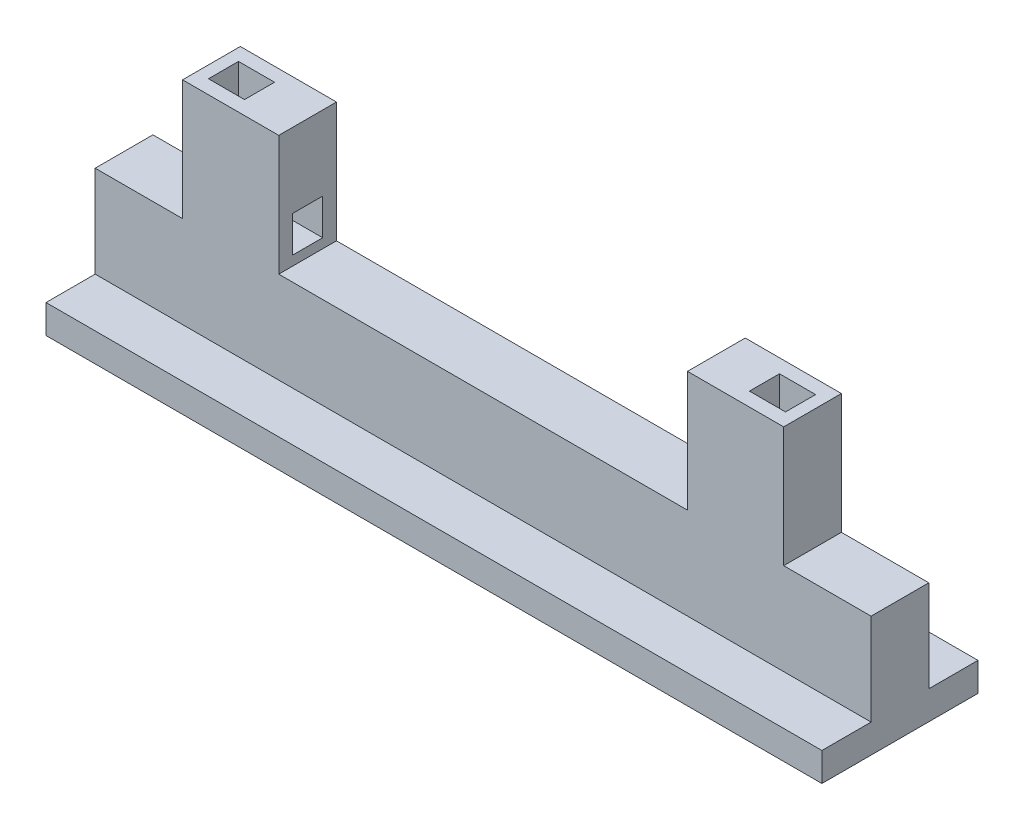
ISO-10303-21;
HEADER;
FILE_DESCRIPTION(('STEP AP214'),'2;1');
FILE_NAME('part.step','',(''),(''),'','','');
FILE_SCHEMA(('AUTOMOTIVE_DESIGN { 1 0 10303 214 1 1 1 1 }'));
ENDSEC;
DATA;
#1=APPLICATION_CONTEXT('core data for automotive mechanical design processes');
#2=APPLICATION_PROTOCOL_DEFINITION('international standard','automotive_design',2000,#1);
#3=PRODUCT_CONTEXT('',#1,'mechanical');
#4=PRODUCT('Part','Part','',(#3));
#5=PRODUCT_RELATED_PRODUCT_CATEGORY('part','',(#4));
#6=PRODUCT_DEFINITION_FORMATION('','',#4);
#7=PRODUCT_DEFINITION_CONTEXT('part definition',#1,'design');
#8=PRODUCT_DEFINITION('design','',#6,#7);
#9=PRODUCT_DEFINITION_SHAPE('','',#8);
#10=(LENGTH_UNIT() NAMED_UNIT(*) SI_UNIT(.MILLI.,.METRE.));
#11=(NAMED_UNIT(*) PLANE_ANGLE_UNIT() SI_UNIT($,.RADIAN.));
#12=(NAMED_UNIT(*) SI_UNIT($,.STERADIAN.) SOLID_ANGLE_UNIT());
#13=UNCERTAINTY_MEASURE_WITH_UNIT(LENGTH_MEASURE(1.E-05),#10,'distance_accuracy_value','');
#14=(GEOMETRIC_REPRESENTATION_CONTEXT(3) GLOBAL_UNCERTAINTY_ASSIGNED_CONTEXT((#13)) GLOBAL_UNIT_ASSIGNED_CONTEXT((#10,
#11,#12)) REPRESENTATION_CONTEXT('',''));
#15=CARTESIAN_POINT('',(0.,0.,0.));
#16=DIRECTION('',(0.,0.,1.));
#17=DIRECTION('',(1.,0.,0.));
#18=AXIS2_PLACEMENT_3D('',#15,#16,#17);
#19=CARTESIAN_POINT('',(32.27,-4.318,1.85852349845481));
#20=DIRECTION('',(0.,1.,0.));
#21=DIRECTION('',(0.,0.,1.));
#22=AXIS2_PLACEMENT_3D('',#19,#20,#21);
#23=PLANE('',#22);
#24=DIRECTION('',(0.,0.,1.));
#25=VECTOR('',#24,1.);
#26=CARTESIAN_POINT('',(57.27,-4.318,-2.94456844452775));
#27=LINE('',#26,#25);
#28=CARTESIAN_POINT('',(57.27,-4.318,-2.94456844452775));
#29=VERTEX_POINT('',#28);
#30=CARTESIAN_POINT('',(57.27,-4.318,1.85852349845481));
#31=VERTEX_POINT('',#30);
#32=EDGE_CURVE('E425',#29,#31,#27,.T.);
#33=ORIENTED_EDGE('',*,*,#32,.T.);
#34=DIRECTION('',(-1.,0.,0.));
#35=VECTOR('',#34,1.);
#36=CARTESIAN_POINT('',(32.27,-4.318,1.85852349845481));
#37=LINE('',#36,#35);
#38=CARTESIAN_POINT('',(64.54,-4.318,1.85852349845481));
#39=VERTEX_POINT('',#38);
#40=EDGE_CURVE('E617',#39,#31,#37,.T.);
#41=ORIENTED_EDGE('',*,*,#40,.F.);
#42=DIRECTION('',(0.,0.,-1.));
#43=VECTOR('',#42,1.);
#44=CARTESIAN_POINT('',(64.54,-4.318,1.85852349845481));
#45=LINE('',#44,#43);
#46=CARTESIAN_POINT('',(64.54,-4.318,-2.94456844452775));
#47=VERTEX_POINT('',#46);
#48=EDGE_CURVE('E479',#39,#47,#45,.T.);
#49=ORIENTED_EDGE('',*,*,#48,.T.);
#50=DIRECTION('',(-1.,0.,0.));
#51=VECTOR('',#50,1.);
#52=CARTESIAN_POINT('',(32.27,-4.318,-2.94456844452775));
#53=LINE('',#52,#51);
#54=EDGE_CURVE('E624',#47,#29,#53,.T.);
#55=ORIENTED_EDGE('',*,*,#54,.T.);
#56=EDGE_LOOP('',(#33,#41,#49,#55));
#57=FACE_BOUND('',#56,.T.);
#58=ADVANCED_FACE('F141',(#57),#23,.T.);
#59=CARTESIAN_POINT('',(15.27,5.682,-2.94456844452775));
#60=DIRECTION('',(-1.,0.,0.));
#61=DIRECTION('',(0.,0.,1.));
#62=AXIS2_PLACEMENT_3D('',#59,#60,#61);
#63=PLANE('',#62);
#64=DIRECTION('',(0.,0.,-1.));
#65=VECTOR('',#64,1.);
#66=CARTESIAN_POINT('',(15.27,-4.318,-2.94456844452775));
#67=LINE('',#66,#65);
#68=CARTESIAN_POINT('',(15.27,-4.318,1.85852349845481));
#69=VERTEX_POINT('',#68);
#70=CARTESIAN_POINT('',(15.27,-4.318,-2.94456844452775));
#71=VERTEX_POINT('',#70);
#72=EDGE_CURVE('E571',#69,#71,#67,.T.);
#73=ORIENTED_EDGE('',*,*,#72,.T.);
#74=DIRECTION('',(0.,-1.,0.));
#75=VECTOR('',#74,1.);
#76=CARTESIAN_POINT('',(15.27,5.682,-2.94456844452775));
#77=LINE('',#76,#75);
#78=CARTESIAN_POINT('',(15.27,5.682,-2.94456844452775));
#79=VERTEX_POINT('',#78);
#80=EDGE_CURVE('E590',#79,#71,#77,.T.);
#81=ORIENTED_EDGE('',*,*,#80,.F.);
#82=DIRECTION('',(0.,0.,-1.));
#83=VECTOR('',#82,1.);
#84=CARTESIAN_POINT('',(15.27,5.682,-2.94456844452775));
#85=LINE('',#84,#83);
#86=CARTESIAN_POINT('',(15.27,5.682,1.85852349845481));
#87=VERTEX_POINT('',#86);
#88=EDGE_CURVE('E574',#87,#79,#85,.T.);
#89=ORIENTED_EDGE('',*,*,#88,.F.);
#90=DIRECTION('',(0.,-1.,0.));
#91=VECTOR('',#90,1.);
#92=CARTESIAN_POINT('',(15.27,5.682,1.85852349845481));
#93=LINE('',#92,#91);
#94=EDGE_CURVE('E594',#87,#69,#93,.T.);
#95=ORIENTED_EDGE('',*,*,#94,.T.);
#96=EDGE_LOOP('',(#73,#81,#89,#95));
#97=FACE_BOUND('',#96,.T.);
#98=DIRECTION('',(0.,0.,1.));
#99=VECTOR('',#98,1.);
#100=CARTESIAN_POINT('',(15.27,-0.520355546125317,-1.79302247303647));
#101=LINE('',#100,#99);
#102=CARTESIAN_POINT('',(15.27,-0.520355546125317,-1.79302247303647));
#103=VERTEX_POINT('',#102);
#104=CARTESIAN_POINT('',(15.27,-0.520355546125317,0.706977526963533));
#105=VERTEX_POINT('',#104);
#106=EDGE_CURVE('E518',#103,#105,#101,.T.);
#107=ORIENTED_EDGE('',*,*,#106,.F.);
#108=DIRECTION('',(0.,-1.,0.));
#109=VECTOR('',#108,1.);
#110=CARTESIAN_POINT('',(15.27,-0.520355546125317,-1.79302247303647));
#111=LINE('',#110,#109);
#112=CARTESIAN_POINT('',(15.27,-3.52035554612532,-1.79302247303647));
#113=VERTEX_POINT('',#112);
#114=EDGE_CURVE('E549',#103,#113,#111,.T.);
#115=ORIENTED_EDGE('',*,*,#114,.T.);
#116=DIRECTION('',(0.,0.,1.));
#117=VECTOR('',#116,1.);
#118=CARTESIAN_POINT('',(15.27,-3.52035554612532,-1.79302247303647));
#119=LINE('',#118,#117);
#120=CARTESIAN_POINT('',(15.27,-3.52035554612532,0.706977526963533));
#121=VERTEX_POINT('',#120);
#122=EDGE_CURVE('E554',#113,#121,#119,.T.);
#123=ORIENTED_EDGE('',*,*,#122,.T.);
#124=DIRECTION('',(0.,-1.,0.));
#125=VECTOR('',#124,1.);
#126=CARTESIAN_POINT('',(15.27,-0.520355546125317,0.706977526963533));
#127=LINE('',#126,#125);
#128=EDGE_CURVE('E550',#105,#121,#127,.T.);
#129=ORIENTED_EDGE('',*,*,#128,.F.);
#130=EDGE_LOOP('',(#107,#115,#123,#129));
#131=FACE_BOUND('',#130,.T.);
#132=ADVANCED_FACE('F705',(#97,#131),#63,.F.);
#133=CARTESIAN_POINT('',(0.,5.682,0.));
#134=DIRECTION('',(0.,1.,0.));
#135=DIRECTION('',(0.,0.,1.));
#136=AXIS2_PLACEMENT_3D('',#133,#134,#135);
#137=PLANE('',#136);
#138=DIRECTION('',(0.,0.,1.));
#139=VECTOR('',#138,1.);
#140=CARTESIAN_POINT('',(7.27000000000001,5.682,-2.94456844452775));
#141=LINE('',#140,#139);
#142=CARTESIAN_POINT('',(7.27000000000001,5.682,-2.94456844452775));
#143=VERTEX_POINT('',#142);
#144=CARTESIAN_POINT('',(7.27000000000001,5.682,1.85852349845481));
#145=VERTEX_POINT('',#144);
#146=EDGE_CURVE('E566',#143,#145,#141,.T.);
#147=ORIENTED_EDGE('',*,*,#146,.T.);
#148=DIRECTION('',(1.,0.,0.));
#149=VECTOR('',#148,1.);
#150=CARTESIAN_POINT('',(7.27000000000001,5.682,1.85852349845481));
#151=LINE('',#150,#149);
#152=EDGE_CURVE('E570',#145,#87,#151,.T.);
#153=ORIENTED_EDGE('',*,*,#152,.T.);
#154=ORIENTED_EDGE('',*,*,#88,.T.);
#155=DIRECTION('',(-1.,0.,0.));
#156=VECTOR('',#155,1.);
#157=CARTESIAN_POINT('',(7.27000000000001,5.682,-2.94456844452775));
#158=LINE('',#157,#156);
#159=EDGE_CURVE('E577',#79,#143,#158,.T.);
#160=ORIENTED_EDGE('',*,*,#159,.T.);
#161=EDGE_LOOP('',(#147,#153,#154,#160));
#162=FACE_BOUND('',#161,.T.);
#163=DIRECTION('',(0.,0.,1.));
#164=VECTOR('',#163,1.);
#165=CARTESIAN_POINT('',(11.27,5.682,-1.79302247303647));
#166=LINE('',#165,#164);
#167=CARTESIAN_POINT('',(11.27,5.682,-1.79302247303647));
#168=VERTEX_POINT('',#167);
#169=CARTESIAN_POINT('',(11.27,5.682,0.706977526963533));
#170=VERTEX_POINT('',#169);
#171=EDGE_CURVE('E512',#168,#170,#166,.T.);
#172=ORIENTED_EDGE('',*,*,#171,.T.);
#173=DIRECTION('',(-1.,0.,0.));
#174=VECTOR('',#173,1.);
#175=CARTESIAN_POINT('',(0.,5.682,0.706977526963533));
#176=LINE('',#175,#174);
#177=CARTESIAN_POINT('',(8.27000000000001,5.682,0.706977526963533));
#178=VERTEX_POINT('',#177);
#179=EDGE_CURVE('E497',#170,#178,#176,.T.);
#180=ORIENTED_EDGE('',*,*,#179,.T.);
#181=DIRECTION('',(0.,0.,1.));
#182=VECTOR('',#181,1.);
#183=CARTESIAN_POINT('',(8.27000000000001,5.682,-1.79302247303647));
#184=LINE('',#183,#182);
#185=CARTESIAN_POINT('',(8.27000000000001,5.682,-1.79302247303647));
#186=VERTEX_POINT('',#185);
#187=EDGE_CURVE('E535',#186,#178,#184,.T.);
#188=ORIENTED_EDGE('',*,*,#187,.F.);
#189=DIRECTION('',(-1.,0.,0.));
#190=VECTOR('',#189,1.);
#191=CARTESIAN_POINT('',(0.,5.682,-1.79302247303647));
#192=LINE('',#191,#190);
#193=EDGE_CURVE('E508',#168,#186,#192,.T.);
#194=ORIENTED_EDGE('',*,*,#193,.F.);
#195=EDGE_LOOP('',(#172,#180,#188,#194));
#196=FACE_BOUND('',#195,.T.);
#197=ADVANCED_FACE('F693',(#162,#196),#137,.T.);
#198=DIRECTION('',(0.,0.,1.));
#199=VECTOR('',#198,1.);
#200=CARTESIAN_POINT('',(7.27000000000001,-4.318,-2.94456844452775));
#201=LINE('',#200,#199);
#202=CARTESIAN_POINT('',(7.27000000000001,-4.318,-2.94456844452775));
#203=VERTEX_POINT('',#202);
#204=CARTESIAN_POINT('',(7.27000000000001,-4.318,1.85852349845481));
#205=VERTEX_POINT('',#204);
#206=EDGE_CURVE('E544',#203,#205,#201,.T.);
#207=ORIENTED_EDGE('',*,*,#206,.F.);
#208=CARTESIAN_POINT('',(0.,-4.318,-2.94456844452775));
#209=VERTEX_POINT('',#208);
#210=EDGE_CURVE('E616',#203,#209,#53,.T.);
#211=ORIENTED_EDGE('',*,*,#210,.T.);
#212=DIRECTION('',(0.,0.,-1.));
#213=VECTOR('',#212,1.);
#214=CARTESIAN_POINT('',(0.,-4.318,1.85852349845481));
#215=LINE('',#214,#213);
#216=CARTESIAN_POINT('',(0.,-4.318,1.85852349845481));
#217=VERTEX_POINT('',#216);
#218=EDGE_CURVE('E603',#217,#209,#215,.T.);
#219=ORIENTED_EDGE('',*,*,#218,.F.);
#220=EDGE_CURVE('E623',#205,#217,#37,.T.);
#221=ORIENTED_EDGE('',*,*,#220,.F.);
#222=EDGE_LOOP('',(#207,#211,#219,#221));
#223=FACE_BOUND('',#222,.T.);
#224=ADVANCED_FACE('F712',(#223),#23,.T.);
#225=CARTESIAN_POINT('',(32.27,-4.318,-2.94456844452775));
#226=DIRECTION('',(0.,0.,-1.));
#227=DIRECTION('',(0.,1.,0.));
#228=AXIS2_PLACEMENT_3D('',#225,#226,#227);
#229=PLANE('',#228);
#230=DIRECTION('',(1.,0.,0.));
#231=VECTOR('',#230,1.);
#232=CARTESIAN_POINT('',(32.27,-11.9498189556856,-2.94456844452775));
#233=LINE('',#232,#231);
#234=CARTESIAN_POINT('',(0.,-11.9498189556856,-2.94456844452775));
#235=VERTEX_POINT('',#234);
#236=CARTESIAN_POINT('',(64.54,-11.9498189556856,-2.94456844452775));
#237=VERTEX_POINT('',#236);
#238=EDGE_CURVE('E621',#235,#237,#233,.T.);
#239=ORIENTED_EDGE('',*,*,#238,.F.);
#240=DIRECTION('',(0.,-1.,0.));
#241=VECTOR('',#240,1.);
#242=CARTESIAN_POINT('',(0.,-4.318,-2.94456844452775));
#243=LINE('',#242,#241);
#244=EDGE_CURVE('E607',#209,#235,#243,.T.);
#245=ORIENTED_EDGE('',*,*,#244,.F.);
#246=ORIENTED_EDGE('',*,*,#210,.F.);
#247=DIRECTION('',(0.,-1.,0.));
#248=VECTOR('',#247,1.);
#249=CARTESIAN_POINT('',(7.27000000000001,5.682,-2.94456844452775));
#250=LINE('',#249,#248);
#251=EDGE_CURVE('E580',#143,#203,#250,.T.);
#252=ORIENTED_EDGE('',*,*,#251,.F.);
#253=ORIENTED_EDGE('',*,*,#159,.F.);
#254=ORIENTED_EDGE('',*,*,#80,.T.);
#255=CARTESIAN_POINT('',(49.27,-4.318,-2.94456844452775));
#256=VERTEX_POINT('',#255);
#257=EDGE_CURVE('E628',#256,#71,#53,.T.);
#258=ORIENTED_EDGE('',*,*,#257,.F.);
#259=DIRECTION('',(0.,-1.,0.));
#260=VECTOR('',#259,1.);
#261=CARTESIAN_POINT('',(49.27,5.682,-2.94456844452775));
#262=LINE('',#261,#260);
#263=CARTESIAN_POINT('',(49.27,5.682,-2.94456844452775));
#264=VERTEX_POINT('',#263);
#265=EDGE_CURVE('E456',#264,#256,#262,.T.);
#266=ORIENTED_EDGE('',*,*,#265,.F.);
#267=DIRECTION('',(1.,0.,0.));
#268=VECTOR('',#267,1.);
#269=CARTESIAN_POINT('',(57.27,5.682,-2.94456844452775));
#270=LINE('',#269,#268);
#271=CARTESIAN_POINT('',(57.27,5.682,-2.94456844452775));
#272=VERTEX_POINT('',#271);
#273=EDGE_CURVE('E430',#264,#272,#270,.T.);
#274=ORIENTED_EDGE('',*,*,#273,.T.);
#275=DIRECTION('',(0.,-1.,0.));
#276=VECTOR('',#275,1.);
#277=CARTESIAN_POINT('',(57.27,5.682,-2.94456844452775));
#278=LINE('',#277,#276);
#279=EDGE_CURVE('E459',#272,#29,#278,.T.);
#280=ORIENTED_EDGE('',*,*,#279,.T.);
#281=ORIENTED_EDGE('',*,*,#54,.F.);
#282=DIRECTION('',(0.,-1.,0.));
#283=VECTOR('',#282,1.);
#284=CARTESIAN_POINT('',(64.54,-4.318,-2.94456844452775));
#285=LINE('',#284,#283);
#286=EDGE_CURVE('E487',#47,#237,#285,.T.);
#287=ORIENTED_EDGE('',*,*,#286,.T.);
#288=EDGE_LOOP('',(#239,#245,#246,#252,#253,#254,#258,#266,#274,#280,#281,#287));
#289=FACE_BOUND('',#288,.T.);
#290=ADVANCED_FACE('F736',(#289),#229,.T.);
#291=DIRECTION('',(0.,0.,-1.));
#292=VECTOR('',#291,1.);
#293=CARTESIAN_POINT('',(49.27,-4.318,-2.94456844452775));
#294=LINE('',#293,#292);
#295=CARTESIAN_POINT('',(49.27,-4.318,1.85852349845481));
#296=VERTEX_POINT('',#295);
#297=EDGE_CURVE('E431',#296,#256,#294,.T.);
#298=ORIENTED_EDGE('',*,*,#297,.T.);
#299=ORIENTED_EDGE('',*,*,#257,.T.);
#300=ORIENTED_EDGE('',*,*,#72,.F.);
#301=EDGE_CURVE('E622',#296,#69,#37,.T.);
#302=ORIENTED_EDGE('',*,*,#301,.F.);
#303=EDGE_LOOP('',(#298,#299,#300,#302));
#304=FACE_BOUND('',#303,.T.);
#305=ADVANCED_FACE('F718',(#304),#23,.T.);
#306=CARTESIAN_POINT('',(32.27,-4.318,1.85852349845481));
#307=DIRECTION('',(0.,0.,-1.));
#308=DIRECTION('',(-1.,0.,0.));
#309=AXIS2_PLACEMENT_3D('',#306,#307,#308);
#310=PLANE('',#309);
#311=DIRECTION('',(0.,-1.,0.));
#312=VECTOR('',#311,1.);
#313=CARTESIAN_POINT('',(0.,-4.318,1.85852349845481));
#314=LINE('',#313,#312);
#315=CARTESIAN_POINT('',(0.,-11.9498189556856,1.85852349845481));
#316=VERTEX_POINT('',#315);
#317=EDGE_CURVE('E612',#217,#316,#314,.T.);
#318=ORIENTED_EDGE('',*,*,#317,.T.);
#319=DIRECTION('',(1.,0.,0.));
#320=VECTOR('',#319,1.);
#321=CARTESIAN_POINT('',(32.27,-11.9498189556856,1.85852349845481));
#322=LINE('',#321,#320);
#323=CARTESIAN_POINT('',(64.54,-11.9498189556856,1.85852349845481));
#324=VERTEX_POINT('',#323);
#325=EDGE_CURVE('E660',#316,#324,#322,.T.);
#326=ORIENTED_EDGE('',*,*,#325,.T.);
#327=DIRECTION('',(0.,-1.,0.));
#328=VECTOR('',#327,1.);
#329=CARTESIAN_POINT('',(64.54,-4.318,1.85852349845481));
#330=LINE('',#329,#328);
#331=EDGE_CURVE('E483',#39,#324,#330,.T.);
#332=ORIENTED_EDGE('',*,*,#331,.F.);
#333=ORIENTED_EDGE('',*,*,#40,.T.);
#334=DIRECTION('',(0.,-1.,0.));
#335=VECTOR('',#334,1.);
#336=CARTESIAN_POINT('',(57.27,5.682,1.85852349845481));
#337=LINE('',#336,#335);
#338=CARTESIAN_POINT('',(57.27,5.682,1.85852349845481));
#339=VERTEX_POINT('',#338);
#340=EDGE_CURVE('E443',#339,#31,#337,.T.);
#341=ORIENTED_EDGE('',*,*,#340,.F.);
#342=DIRECTION('',(-1.,0.,0.));
#343=VECTOR('',#342,1.);
#344=CARTESIAN_POINT('',(57.27,5.682,1.85852349845481));
#345=LINE('',#344,#343);
#346=CARTESIAN_POINT('',(49.27,5.682,1.85852349845481));
#347=VERTEX_POINT('',#346);
#348=EDGE_CURVE('E439',#339,#347,#345,.T.);
#349=ORIENTED_EDGE('',*,*,#348,.T.);
#350=DIRECTION('',(0.,-1.,0.));
#351=VECTOR('',#350,1.);
#352=CARTESIAN_POINT('',(49.27,5.682,1.85852349845481));
#353=LINE('',#352,#351);
#354=EDGE_CURVE('E452',#347,#296,#353,.T.);
#355=ORIENTED_EDGE('',*,*,#354,.T.);
#356=ORIENTED_EDGE('',*,*,#301,.T.);
#357=ORIENTED_EDGE('',*,*,#94,.F.);
#358=ORIENTED_EDGE('',*,*,#152,.F.);
#359=DIRECTION('',(0.,-1.,0.));
#360=VECTOR('',#359,1.);
#361=CARTESIAN_POINT('',(7.27000000000001,5.682,1.85852349845481));
#362=LINE('',#361,#360);
#363=EDGE_CURVE('E598',#145,#205,#362,.T.);
#364=ORIENTED_EDGE('',*,*,#363,.T.);
#365=ORIENTED_EDGE('',*,*,#220,.T.);
#366=EDGE_LOOP('',(#318,#326,#332,#333,#341,#349,#355,#356,#357,#358,#364,#365));
#367=FACE_BOUND('',#366,.T.);
#368=ADVANCED_FACE('F731',(#367),#310,.F.);
#369=CARTESIAN_POINT('',(0.,0.,0.));
#370=DIRECTION('',(-1.,0.,0.));
#371=DIRECTION('',(0.,0.,1.));
#372=AXIS2_PLACEMENT_3D('',#369,#370,#371);
#373=PLANE('',#372);
#374=ORIENTED_EDGE('',*,*,#244,.T.);
#375=DIRECTION('',(0.,0.,-1.));
#376=VECTOR('',#375,1.);
#377=CARTESIAN_POINT('',(0.,-11.9498189556856,5.94914912418009));
#378=LINE('',#377,#376);
#379=CARTESIAN_POINT('',(0.,-11.9498189556856,-7.03519407025302));
#380=VERTEX_POINT('',#379);
#381=EDGE_CURVE('E640',#235,#380,#378,.T.);
#382=ORIENTED_EDGE('',*,*,#381,.T.);
#383=DIRECTION('',(0.,-1.,0.));
#384=VECTOR('',#383,1.);
#385=CARTESIAN_POINT('',(0.,-11.9498189556856,-7.03519407025302));
#386=LINE('',#385,#384);
#387=CARTESIAN_POINT('',(0.,-14.3305901853775,-7.03519407025302));
#388=VERTEX_POINT('',#387);
#389=EDGE_CURVE('E636',#380,#388,#386,.T.);
#390=ORIENTED_EDGE('',*,*,#389,.T.);
#391=DIRECTION('',(0.,0.,-1.));
#392=VECTOR('',#391,1.);
#393=CARTESIAN_POINT('',(0.,-14.3305901853775,5.94914912418009));
#394=LINE('',#393,#392);
#395=CARTESIAN_POINT('',(0.,-14.3305901853775,5.94914912418009));
#396=VERTEX_POINT('',#395);
#397=EDGE_CURVE('E632',#396,#388,#394,.T.);
#398=ORIENTED_EDGE('',*,*,#397,.F.);
#399=DIRECTION('',(0.,-1.,0.));
#400=VECTOR('',#399,1.);
#401=CARTESIAN_POINT('',(0.,-11.9498189556856,5.94914912418009));
#402=LINE('',#401,#400);
#403=CARTESIAN_POINT('',(0.,-11.9498189556856,5.94914912418009));
#404=VERTEX_POINT('',#403);
#405=EDGE_CURVE('E602',#404,#396,#402,.T.);
#406=ORIENTED_EDGE('',*,*,#405,.F.);
#407=EDGE_CURVE('E641',#404,#316,#378,.T.);
#408=ORIENTED_EDGE('',*,*,#407,.T.);
#409=ORIENTED_EDGE('',*,*,#317,.F.);
#410=ORIENTED_EDGE('',*,*,#218,.T.);
#411=EDGE_LOOP('',(#374,#382,#390,#398,#406,#408,#409,#410));
#412=FACE_BOUND('',#411,.T.);
#413=ADVANCED_FACE('F727',(#412),#373,.T.);
#414=CARTESIAN_POINT('',(32.27,-11.9498189556856,5.94914912418009));
#415=DIRECTION('',(0.,0.,-1.));
#416=DIRECTION('',(-1.,0.,0.));
#417=AXIS2_PLACEMENT_3D('',#414,#415,#416);
#418=PLANE('',#417);
#419=ORIENTED_EDGE('',*,*,#405,.T.);
#420=DIRECTION('',(-1.,0.,0.));
#421=VECTOR('',#420,1.);
#422=CARTESIAN_POINT('',(32.27,-14.3305901853775,5.94914912418009));
#423=LINE('',#422,#421);
#424=CARTESIAN_POINT('',(64.54,-14.3305901853775,5.94914912418009));
#425=VERTEX_POINT('',#424);
#426=EDGE_CURVE('E608',#425,#396,#423,.T.);
#427=ORIENTED_EDGE('',*,*,#426,.F.);
#428=DIRECTION('',(0.,-1.,0.));
#429=VECTOR('',#428,1.);
#430=CARTESIAN_POINT('',(64.54,-11.9498189556856,5.94914912418009));
#431=LINE('',#430,#429);
#432=CARTESIAN_POINT('',(64.54,-11.9498189556856,5.94914912418009));
#433=VERTEX_POINT('',#432);
#434=EDGE_CURVE('E462',#433,#425,#431,.T.);
#435=ORIENTED_EDGE('',*,*,#434,.F.);
#436=DIRECTION('',(-1.,0.,0.));
#437=VECTOR('',#436,1.);
#438=CARTESIAN_POINT('',(32.27,-11.9498189556856,5.94914912418009));
#439=LINE('',#438,#437);
#440=EDGE_CURVE('E645',#433,#404,#439,.T.);
#441=ORIENTED_EDGE('',*,*,#440,.T.);
#442=EDGE_LOOP('',(#419,#427,#435,#441));
#443=FACE_BOUND('',#442,.T.);
#444=ADVANCED_FACE('F730',(#443),#418,.F.);
#445=CARTESIAN_POINT('',(32.27,-14.3305901853775,5.94914912418009));
#446=DIRECTION('',(0.,1.,0.));
#447=DIRECTION('',(0.,0.,1.));
#448=AXIS2_PLACEMENT_3D('',#445,#446,#447);
#449=PLANE('',#448);
#450=ORIENTED_EDGE('',*,*,#397,.T.);
#451=DIRECTION('',(-1.,0.,0.));
#452=VECTOR('',#451,1.);
#453=CARTESIAN_POINT('',(32.27,-14.3305901853775,-7.03519407025302));
#454=LINE('',#453,#452);
#455=CARTESIAN_POINT('',(64.54,-14.3305901853775,-7.03519407025302));
#456=VERTEX_POINT('',#455);
#457=EDGE_CURVE('E652',#456,#388,#454,.T.);
#458=ORIENTED_EDGE('',*,*,#457,.F.);
#459=DIRECTION('',(0.,0.,-1.));
#460=VECTOR('',#459,1.);
#461=CARTESIAN_POINT('',(64.54,-14.3305901853775,5.94914912418009));
#462=LINE('',#461,#460);
#463=EDGE_CURVE('E475',#425,#456,#462,.T.);
#464=ORIENTED_EDGE('',*,*,#463,.F.);
#465=ORIENTED_EDGE('',*,*,#426,.T.);
#466=EDGE_LOOP('',(#450,#458,#464,#465));
#467=FACE_BOUND('',#466,.T.);
#468=ADVANCED_FACE('F748',(#467),#449,.F.);
#469=CARTESIAN_POINT('',(32.27,-11.9498189556856,-7.03519407025302));
#470=DIRECTION('',(0.,0.,-1.));
#471=DIRECTION('',(-1.,0.,0.));
#472=AXIS2_PLACEMENT_3D('',#469,#470,#471);
#473=PLANE('',#472);
#474=ORIENTED_EDGE('',*,*,#389,.F.);
#475=DIRECTION('',(-1.,0.,0.));
#476=VECTOR('',#475,1.);
#477=CARTESIAN_POINT('',(32.27,-11.9498189556856,-7.03519407025302));
#478=LINE('',#477,#476);
#479=CARTESIAN_POINT('',(64.54,-11.9498189556856,-7.03519407025302));
#480=VERTEX_POINT('',#479);
#481=EDGE_CURVE('E648',#480,#380,#478,.T.);
#482=ORIENTED_EDGE('',*,*,#481,.F.);
#483=DIRECTION('',(0.,-1.,0.));
#484=VECTOR('',#483,1.);
#485=CARTESIAN_POINT('',(64.54,-11.9498189556856,-7.03519407025302));
#486=LINE('',#485,#484);
#487=EDGE_CURVE('E471',#480,#456,#486,.T.);
#488=ORIENTED_EDGE('',*,*,#487,.T.);
#489=ORIENTED_EDGE('',*,*,#457,.T.);
#490=EDGE_LOOP('',(#474,#482,#488,#489));
#491=FACE_BOUND('',#490,.T.);
#492=ADVANCED_FACE('F744',(#491),#473,.T.);
#493=CARTESIAN_POINT('',(32.27,-11.9498189556856,5.94914912418009));
#494=DIRECTION('',(0.,1.,0.));
#495=DIRECTION('',(0.,0.,1.));
#496=AXIS2_PLACEMENT_3D('',#493,#494,#495);
#497=PLANE('',#496);
#498=ORIENTED_EDGE('',*,*,#381,.F.);
#499=ORIENTED_EDGE('',*,*,#238,.T.);
#500=DIRECTION('',(0.,0.,-1.));
#501=VECTOR('',#500,1.);
#502=CARTESIAN_POINT('',(64.54,-11.9498189556856,5.94914912418009));
#503=LINE('',#502,#501);
#504=EDGE_CURVE('E466',#237,#480,#503,.T.);
#505=ORIENTED_EDGE('',*,*,#504,.T.);
#506=ORIENTED_EDGE('',*,*,#481,.T.);
#507=EDGE_LOOP('',(#498,#499,#505,#506));
#508=FACE_BOUND('',#507,.T.);
#509=ADVANCED_FACE('F726',(#508),#497,.T.);
#510=ORIENTED_EDGE('',*,*,#325,.F.);
#511=ORIENTED_EDGE('',*,*,#407,.F.);
#512=ORIENTED_EDGE('',*,*,#440,.F.);
#513=EDGE_CURVE('E467',#433,#324,#503,.T.);
#514=ORIENTED_EDGE('',*,*,#513,.T.);
#515=EDGE_LOOP('',(#510,#511,#512,#514));
#516=FACE_BOUND('',#515,.T.);
#517=ADVANCED_FACE('F724',(#516),#497,.T.);
#518=CARTESIAN_POINT('',(7.27000000000001,5.682,-2.94456844452775));
#519=DIRECTION('',(1.,0.,0.));
#520=DIRECTION('',(0.,0.,-1.));
#521=AXIS2_PLACEMENT_3D('',#518,#519,#520);
#522=PLANE('',#521);
#523=ORIENTED_EDGE('',*,*,#206,.T.);
#524=ORIENTED_EDGE('',*,*,#363,.F.);
#525=ORIENTED_EDGE('',*,*,#146,.F.);
#526=ORIENTED_EDGE('',*,*,#251,.T.);
#527=EDGE_LOOP('',(#523,#524,#525,#526));
#528=FACE_BOUND('',#527,.T.);
#529=ADVANCED_FACE('F721',(#528),#522,.F.);
#530=CARTESIAN_POINT('',(0.,-0.520355546125317,-1.79302247303647));
#531=DIRECTION('',(0.,-1.,0.));
#532=DIRECTION('',(1.,0.,0.));
#533=AXIS2_PLACEMENT_3D('',#530,#531,#532);
#534=PLANE('',#533);
#535=DIRECTION('',(1.,0.,0.));
#536=VECTOR('',#535,1.);
#537=CARTESIAN_POINT('',(0.,-0.520355546125317,0.706977526963533));
#538=LINE('',#537,#536);
#539=CARTESIAN_POINT('',(14.27,-0.520355546125317,0.706977526963533));
#540=VERTEX_POINT('',#539);
#541=EDGE_CURVE('E517',#540,#105,#538,.T.);
#542=ORIENTED_EDGE('',*,*,#541,.F.);
#543=DIRECTION('',(0.,0.,1.));
#544=VECTOR('',#543,1.);
#545=CARTESIAN_POINT('',(14.27,-0.520355546125317,-1.79302247303647));
#546=LINE('',#545,#544);
#547=CARTESIAN_POINT('',(14.27,-0.520355546125317,-1.79302247303647));
#548=VERTEX_POINT('',#547);
#549=EDGE_CURVE('E667',#540,#548,#546,.F.);
#550=ORIENTED_EDGE('',*,*,#549,.T.);
#551=DIRECTION('',(1.,0.,0.));
#552=VECTOR('',#551,1.);
#553=CARTESIAN_POINT('',(0.,-0.520355546125317,-1.79302247303647));
#554=LINE('',#553,#552);
#555=EDGE_CURVE('E496',#548,#103,#554,.T.);
#556=ORIENTED_EDGE('',*,*,#555,.T.);
#557=ORIENTED_EDGE('',*,*,#106,.T.);
#558=EDGE_LOOP('',(#542,#550,#556,#557));
#559=FACE_BOUND('',#558,.T.);
#560=ADVANCED_FACE('F679',(#559),#534,.T.);
#561=CARTESIAN_POINT('',(8.27000000000001,0.,-1.79302247303647));
#562=DIRECTION('',(-1.,0.,0.));
#563=DIRECTION('',(0.,-1.,0.));
#564=AXIS2_PLACEMENT_3D('',#561,#562,#563);
#565=PLANE('',#564);
#566=DIRECTION('',(0.,-1.,0.));
#567=VECTOR('',#566,1.);
#568=CARTESIAN_POINT('',(8.27000000000001,0.,0.706977526963533));
#569=LINE('',#568,#567);
#570=CARTESIAN_POINT('',(8.27000000000001,-0.520355546125318,0.706977526963533));
#571=VERTEX_POINT('',#570);
#572=EDGE_CURVE('E525',#178,#571,#569,.T.);
#573=ORIENTED_EDGE('',*,*,#572,.T.);
#574=DIRECTION('',(0.,0.,1.));
#575=VECTOR('',#574,1.);
#576=CARTESIAN_POINT('',(8.27000000000001,-0.520355546125318,-1.79302247303647));
#577=LINE('',#576,#575);
#578=CARTESIAN_POINT('',(8.27000000000001,-0.520355546125318,-1.79302247303647));
#579=VERTEX_POINT('',#578);
#580=EDGE_CURVE('E538',#579,#571,#577,.T.);
#581=ORIENTED_EDGE('',*,*,#580,.F.);
#582=DIRECTION('',(0.,-1.,0.));
#583=VECTOR('',#582,1.);
#584=CARTESIAN_POINT('',(8.27000000000001,0.,-1.79302247303647));
#585=LINE('',#584,#583);
#586=EDGE_CURVE('E504',#186,#579,#585,.T.);
#587=ORIENTED_EDGE('',*,*,#586,.F.);
#588=ORIENTED_EDGE('',*,*,#187,.T.);
#589=EDGE_LOOP('',(#573,#581,#587,#588));
#590=FACE_BOUND('',#589,.T.);
#591=ADVANCED_FACE('F696',(#590),#565,.F.);
#592=CARTESIAN_POINT('',(11.27,0.,-1.79302247303647));
#593=DIRECTION('',(-1.,0.,0.));
#594=DIRECTION('',(0.,0.,1.));
#595=AXIS2_PLACEMENT_3D('',#592,#593,#594);
#596=PLANE('',#595);
#597=DIRECTION('',(0.,-1.,0.));
#598=VECTOR('',#597,1.);
#599=CARTESIAN_POINT('',(11.27,0.,-1.79302247303647));
#600=LINE('',#599,#598);
#601=CARTESIAN_POINT('',(11.27,2.47964445387468,-1.79302247303647));
#602=VERTEX_POINT('',#601);
#603=EDGE_CURVE('E492',#168,#602,#600,.T.);
#604=ORIENTED_EDGE('',*,*,#603,.T.);
#605=DIRECTION('',(0.,0.,1.));
#606=VECTOR('',#605,1.);
#607=CARTESIAN_POINT('',(11.27,2.47964445387468,-1.79302247303647));
#608=LINE('',#607,#606);
#609=CARTESIAN_POINT('',(11.27,2.47964445387468,0.706977526963533));
#610=VERTEX_POINT('',#609);
#611=EDGE_CURVE('E663',#602,#610,#608,.T.);
#612=ORIENTED_EDGE('',*,*,#611,.T.);
#613=DIRECTION('',(0.,-1.,0.));
#614=VECTOR('',#613,1.);
#615=CARTESIAN_POINT('',(11.27,0.,0.706977526963533));
#616=LINE('',#615,#614);
#617=EDGE_CURVE('E513',#170,#610,#616,.T.);
#618=ORIENTED_EDGE('',*,*,#617,.F.);
#619=ORIENTED_EDGE('',*,*,#171,.F.);
#620=EDGE_LOOP('',(#604,#612,#618,#619));
#621=FACE_BOUND('',#620,.T.);
#622=ADVANCED_FACE('F689',(#621),#596,.T.);
#623=CARTESIAN_POINT('',(11.27,-0.520355546125317,-1.79302247303647));
#624=DIRECTION('',(0.,0.,1.));
#625=DIRECTION('',(1.,0.,0.));
#626=AXIS2_PLACEMENT_3D('',#623,#624,#625);
#627=CYLINDRICAL_SURFACE('',#626,3.);
#628=DIRECTION('',(0.,0.,1.));
#629=VECTOR('',#628,1.);
#630=CARTESIAN_POINT('',(11.27,-3.52035554612531,-1.79302247303647));
#631=LINE('',#630,#629);
#632=CARTESIAN_POINT('',(11.27,-3.52035554612532,0.706977526963533));
#633=VERTEX_POINT('',#632);
#634=CARTESIAN_POINT('',(11.27,-3.52035554612532,-1.79302247303647));
#635=VERTEX_POINT('',#634);
#636=EDGE_CURVE('E541',#633,#635,#631,.F.);
#637=ORIENTED_EDGE('',*,*,#636,.T.);
#638=CARTESIAN_POINT('',(11.27,-0.520355546125317,-1.79302247303647));
#639=DIRECTION('',(0.,0.,-1.));
#640=DIRECTION('',(0.,1.,0.));
#641=AXIS2_PLACEMENT_3D('',#638,#639,#640);
#642=CIRCLE('',#641,3.);
#643=EDGE_CURVE('E500',#579,#635,#642,.F.);
#644=ORIENTED_EDGE('',*,*,#643,.F.);
#645=ORIENTED_EDGE('',*,*,#580,.T.);
#646=CARTESIAN_POINT('',(11.27,-0.520355546125317,0.706977526963533));
#647=DIRECTION('',(0.,0.,-1.));
#648=DIRECTION('',(0.,1.,0.));
#649=AXIS2_PLACEMENT_3D('',#646,#647,#648);
#650=CIRCLE('',#649,3.);
#651=EDGE_CURVE('E521',#571,#633,#650,.F.);
#652=ORIENTED_EDGE('',*,*,#651,.T.);
#653=EDGE_LOOP('',(#637,#644,#645,#652));
#654=FACE_BOUND('',#653,.T.);
#655=ADVANCED_FACE('F699',(#654),#627,.F.);
#656=CARTESIAN_POINT('',(0.,0.,0.706977526963533));
#657=DIRECTION('',(0.,0.,-1.));
#658=DIRECTION('',(0.,1.,0.));
#659=AXIS2_PLACEMENT_3D('',#656,#657,#658);
#660=PLANE('',#659);
#661=ORIENTED_EDGE('',*,*,#651,.F.);
#662=ORIENTED_EDGE('',*,*,#572,.F.);
#663=ORIENTED_EDGE('',*,*,#179,.F.);
#664=ORIENTED_EDGE('',*,*,#617,.T.);
#665=CARTESIAN_POINT('',(14.27,2.47964445387468,0.706977526963533));
#666=DIRECTION('',(0.,0.,-1.));
#667=DIRECTION('',(0.,1.,0.));
#668=AXIS2_PLACEMENT_3D('',#665,#666,#667);
#669=CIRCLE('',#668,3.);
#670=EDGE_CURVE('E150',#610,#540,#669,.F.);
#671=ORIENTED_EDGE('',*,*,#670,.T.);
#672=ORIENTED_EDGE('',*,*,#541,.T.);
#673=ORIENTED_EDGE('',*,*,#128,.T.);
#674=DIRECTION('',(1.,0.,0.));
#675=VECTOR('',#674,1.);
#676=CARTESIAN_POINT('',(11.27,-3.52035554612532,0.706977526963533));
#677=LINE('',#676,#675);
#678=EDGE_CURVE('E491',#633,#121,#677,.T.);
#679=ORIENTED_EDGE('',*,*,#678,.F.);
#680=EDGE_LOOP('',(#661,#662,#663,#664,#671,#672,#673,#679));
#681=FACE_BOUND('',#680,.T.);
#682=ADVANCED_FACE('F673',(#681),#660,.T.);
#683=CARTESIAN_POINT('',(0.,0.,-1.79302247303647));
#684=DIRECTION('',(0.,0.,-1.));
#685=DIRECTION('',(0.,1.,0.));
#686=AXIS2_PLACEMENT_3D('',#683,#684,#685);
#687=PLANE('',#686);
#688=ORIENTED_EDGE('',*,*,#603,.F.);
#689=ORIENTED_EDGE('',*,*,#193,.T.);
#690=ORIENTED_EDGE('',*,*,#586,.T.);
#691=ORIENTED_EDGE('',*,*,#643,.T.);
#692=DIRECTION('',(1.,0.,0.));
#693=VECTOR('',#692,1.);
#694=CARTESIAN_POINT('',(11.27,-3.52035554612532,-1.79302247303647));
#695=LINE('',#694,#693);
#696=EDGE_CURVE('E545',#635,#113,#695,.T.);
#697=ORIENTED_EDGE('',*,*,#696,.T.);
#698=ORIENTED_EDGE('',*,*,#114,.F.);
#699=ORIENTED_EDGE('',*,*,#555,.F.);
#700=CARTESIAN_POINT('',(14.27,2.47964445387468,-1.79302247303647));
#701=DIRECTION('',(0.,0.,-1.));
#702=DIRECTION('',(0.,1.,0.));
#703=AXIS2_PLACEMENT_3D('',#700,#701,#702);
#704=CIRCLE('',#703,3.);
#705=EDGE_CURVE('E12',#548,#602,#704,.T.);
#706=ORIENTED_EDGE('',*,*,#705,.T.);
#707=EDGE_LOOP('',(#688,#689,#690,#691,#697,#698,#699,#706));
#708=FACE_BOUND('',#707,.T.);
#709=ADVANCED_FACE('F685',(#708),#687,.F.);
#710=CARTESIAN_POINT('',(11.27,-3.52035554612532,-1.79302247303647));
#711=DIRECTION('',(0.,-1.,0.));
#712=DIRECTION('',(0.,0.,-1.));
#713=AXIS2_PLACEMENT_3D('',#710,#711,#712);
#714=PLANE('',#713);
#715=ORIENTED_EDGE('',*,*,#678,.T.);
#716=ORIENTED_EDGE('',*,*,#122,.F.);
#717=ORIENTED_EDGE('',*,*,#696,.F.);
#718=ORIENTED_EDGE('',*,*,#636,.F.);
#719=EDGE_LOOP('',(#715,#716,#717,#718));
#720=FACE_BOUND('',#719,.T.);
#721=ADVANCED_FACE('F703',(#720),#714,.F.);
#722=CARTESIAN_POINT('',(14.27,2.47964445387468,-1.79302247303647));
#723=DIRECTION('',(0.,0.,1.));
#724=DIRECTION('',(1.,0.,0.));
#725=AXIS2_PLACEMENT_3D('',#722,#723,#724);
#726=CYLINDRICAL_SURFACE('',#725,3.);
#727=ORIENTED_EDGE('',*,*,#705,.F.);
#728=ORIENTED_EDGE('',*,*,#549,.F.);
#729=ORIENTED_EDGE('',*,*,#670,.F.);
#730=ORIENTED_EDGE('',*,*,#611,.F.);
#731=EDGE_LOOP('',(#727,#728,#729,#730));
#732=FACE_BOUND('',#731,.T.);
#733=ADVANCED_FACE('F143',(#732),#726,.T.);
#734=CARTESIAN_POINT('',(64.54,0.,0.));
#735=DIRECTION('',(1.,0.,0.));
#736=DIRECTION('',(0.,0.,1.));
#737=AXIS2_PLACEMENT_3D('',#734,#735,#736);
#738=PLANE('',#737);
#739=ORIENTED_EDGE('',*,*,#504,.F.);
#740=ORIENTED_EDGE('',*,*,#286,.F.);
#741=ORIENTED_EDGE('',*,*,#48,.F.);
#742=ORIENTED_EDGE('',*,*,#331,.T.);
#743=ORIENTED_EDGE('',*,*,#513,.F.);
#744=ORIENTED_EDGE('',*,*,#434,.T.);
#745=ORIENTED_EDGE('',*,*,#463,.T.);
#746=ORIENTED_EDGE('',*,*,#487,.F.);
#747=EDGE_LOOP('',(#739,#740,#741,#742,#743,#744,#745,#746));
#748=FACE_BOUND('',#747,.T.);
#749=ADVANCED_FACE('F793',(#748),#738,.T.);
#750=CARTESIAN_POINT('',(57.27,5.682,-2.94456844452775));
#751=DIRECTION('',(1.,0.,0.));
#752=DIRECTION('',(0.,0.,-1.));
#753=AXIS2_PLACEMENT_3D('',#750,#751,#752);
#754=PLANE('',#753);
#755=ORIENTED_EDGE('',*,*,#32,.F.);
#756=ORIENTED_EDGE('',*,*,#279,.F.);
#757=DIRECTION('',(0.,0.,1.));
#758=VECTOR('',#757,1.);
#759=CARTESIAN_POINT('',(57.27,5.682,-2.94456844452775));
#760=LINE('',#759,#758);
#761=EDGE_CURVE('E426',#272,#339,#760,.T.);
#762=ORIENTED_EDGE('',*,*,#761,.T.);
#763=ORIENTED_EDGE('',*,*,#340,.T.);
#764=EDGE_LOOP('',(#755,#756,#762,#763));
#765=FACE_BOUND('',#764,.T.);
#766=ADVANCED_FACE('F799',(#765),#754,.T.);
#767=CARTESIAN_POINT('',(49.27,5.682,-2.94456844452775));
#768=DIRECTION('',(-1.,0.,0.));
#769=DIRECTION('',(0.,0.,1.));
#770=AXIS2_PLACEMENT_3D('',#767,#768,#769);
#771=PLANE('',#770);
#772=DIRECTION('',(0.,0.,1.));
#773=VECTOR('',#772,1.);
#774=CARTESIAN_POINT('',(49.27,-0.520355546125317,-1.79302247303647));
#775=LINE('',#774,#773);
#776=CARTESIAN_POINT('',(49.27,-0.520355546125317,-1.79302247303647));
#777=VERTEX_POINT('',#776);
#778=CARTESIAN_POINT('',(49.27,-0.520355546125317,0.706977526963533));
#779=VERTEX_POINT('',#778);
#780=EDGE_CURVE('E356',#777,#779,#775,.T.);
#781=ORIENTED_EDGE('',*,*,#780,.T.);
#782=DIRECTION('',(0.,-1.,0.));
#783=VECTOR('',#782,1.);
#784=CARTESIAN_POINT('',(49.27,-0.520355546125317,0.706977526963533));
#785=LINE('',#784,#783);
#786=CARTESIAN_POINT('',(49.27,-3.52035554612532,0.706977526963533));
#787=VERTEX_POINT('',#786);
#788=EDGE_CURVE('E376',#779,#787,#785,.T.);
#789=ORIENTED_EDGE('',*,*,#788,.T.);
#790=DIRECTION('',(0.,0.,1.));
#791=VECTOR('',#790,1.);
#792=CARTESIAN_POINT('',(49.27,-3.52035554612532,-1.79302247303647));
#793=LINE('',#792,#791);
#794=CARTESIAN_POINT('',(49.27,-3.52035554612532,-1.79302247303647));
#795=VERTEX_POINT('',#794);
#796=EDGE_CURVE('E363',#795,#787,#793,.T.);
#797=ORIENTED_EDGE('',*,*,#796,.F.);
#798=DIRECTION('',(0.,-1.,0.));
#799=VECTOR('',#798,1.);
#800=CARTESIAN_POINT('',(49.27,-0.520355546125317,-1.79302247303647));
#801=LINE('',#800,#799);
#802=EDGE_CURVE('E157',#777,#795,#801,.T.);
#803=ORIENTED_EDGE('',*,*,#802,.F.);
#804=EDGE_LOOP('',(#781,#789,#797,#803));
#805=FACE_BOUND('',#804,.T.);
#806=ORIENTED_EDGE('',*,*,#297,.F.);
#807=ORIENTED_EDGE('',*,*,#354,.F.);
#808=DIRECTION('',(0.,0.,-1.));
#809=VECTOR('',#808,1.);
#810=CARTESIAN_POINT('',(49.27,5.682,-2.94456844452775));
#811=LINE('',#810,#809);
#812=EDGE_CURVE('E435',#347,#264,#811,.T.);
#813=ORIENTED_EDGE('',*,*,#812,.T.);
#814=ORIENTED_EDGE('',*,*,#265,.T.);
#815=EDGE_LOOP('',(#806,#807,#813,#814));
#816=FACE_BOUND('',#815,.T.);
#817=ADVANCED_FACE('F367',(#805,#816),#771,.T.);
#818=CARTESIAN_POINT('',(64.54,5.682,0.));
#819=DIRECTION('',(0.,1.,0.));
#820=DIRECTION('',(0.,0.,1.));
#821=AXIS2_PLACEMENT_3D('',#818,#819,#820);
#822=PLANE('',#821);
#823=DIRECTION('',(1.,0.,0.));
#824=VECTOR('',#823,1.);
#825=CARTESIAN_POINT('',(64.54,5.682,-1.79302247303647));
#826=LINE('',#825,#824);
#827=CARTESIAN_POINT('',(53.27,5.682,-1.79302247303647));
#828=VERTEX_POINT('',#827);
#829=CARTESIAN_POINT('',(56.27,5.682,-1.79302247303647));
#830=VERTEX_POINT('',#829);
#831=EDGE_CURVE('E389',#828,#830,#826,.T.);
#832=ORIENTED_EDGE('',*,*,#831,.T.);
#833=DIRECTION('',(0.,0.,1.));
#834=VECTOR('',#833,1.);
#835=CARTESIAN_POINT('',(56.27,5.682,-1.79302247303647));
#836=LINE('',#835,#834);
#837=CARTESIAN_POINT('',(56.27,5.682,0.706977526963533));
#838=VERTEX_POINT('',#837);
#839=EDGE_CURVE('E418',#830,#838,#836,.T.);
#840=ORIENTED_EDGE('',*,*,#839,.T.);
#841=DIRECTION('',(1.,0.,0.));
#842=VECTOR('',#841,1.);
#843=CARTESIAN_POINT('',(64.54,5.682,0.706977526963533));
#844=LINE('',#843,#842);
#845=CARTESIAN_POINT('',(53.27,5.682,0.706977526963533));
#846=VERTEX_POINT('',#845);
#847=EDGE_CURVE('E401',#846,#838,#844,.T.);
#848=ORIENTED_EDGE('',*,*,#847,.F.);
#849=DIRECTION('',(0.,0.,1.));
#850=VECTOR('',#849,1.);
#851=CARTESIAN_POINT('',(53.27,5.682,-1.79302247303647));
#852=LINE('',#851,#850);
#853=EDGE_CURVE('E422',#828,#846,#852,.T.);
#854=ORIENTED_EDGE('',*,*,#853,.F.);
#855=EDGE_LOOP('',(#832,#840,#848,#854));
#856=FACE_BOUND('',#855,.T.);
#857=ORIENTED_EDGE('',*,*,#761,.F.);
#858=ORIENTED_EDGE('',*,*,#273,.F.);
#859=ORIENTED_EDGE('',*,*,#812,.F.);
#860=ORIENTED_EDGE('',*,*,#348,.F.);
#861=EDGE_LOOP('',(#857,#858,#859,#860));
#862=FACE_BOUND('',#861,.T.);
#863=ADVANCED_FACE('F805',(#856,#862),#822,.T.);
#864=CARTESIAN_POINT('',(53.27,-0.520355546125317,-1.79302247303647));
#865=DIRECTION('',(0.,0.,1.));
#866=DIRECTION('',(1.,0.,0.));
#867=AXIS2_PLACEMENT_3D('',#864,#865,#866);
#868=CYLINDRICAL_SURFACE('',#867,3.);
#869=DIRECTION('',(0.,0.,1.));
#870=VECTOR('',#869,1.);
#871=CARTESIAN_POINT('',(53.27,-3.52035554612532,-1.79302247303647));
#872=LINE('',#871,#870);
#873=CARTESIAN_POINT('',(53.27,-3.52035554612532,-1.79302247303647));
#874=VERTEX_POINT('',#873);
#875=CARTESIAN_POINT('',(53.27,-3.52035554612532,0.706977526963533));
#876=VERTEX_POINT('',#875);
#877=EDGE_CURVE('E381',#874,#876,#872,.T.);
#878=ORIENTED_EDGE('',*,*,#877,.T.);
#879=CARTESIAN_POINT('',(53.27,-0.520355546125317,0.706977526963533));
#880=DIRECTION('',(0.,0.,1.));
#881=DIRECTION('',(0.,1.,0.));
#882=AXIS2_PLACEMENT_3D('',#879,#880,#881);
#883=CIRCLE('',#882,3.);
#884=CARTESIAN_POINT('',(56.27,-0.520355546125318,0.706977526963533));
#885=VERTEX_POINT('',#884);
#886=EDGE_CURVE('E407',#885,#876,#883,.F.);
#887=ORIENTED_EDGE('',*,*,#886,.F.);
#888=DIRECTION('',(0.,0.,1.));
#889=VECTOR('',#888,1.);
#890=CARTESIAN_POINT('',(56.27,-0.520355546125318,-1.79302247303647));
#891=LINE('',#890,#889);
#892=CARTESIAN_POINT('',(56.27,-0.520355546125318,-1.79302247303647));
#893=VERTEX_POINT('',#892);
#894=EDGE_CURVE('E414',#893,#885,#891,.T.);
#895=ORIENTED_EDGE('',*,*,#894,.F.);
#896=CARTESIAN_POINT('',(53.27,-0.520355546125317,-1.79302247303647));
#897=DIRECTION('',(0.,0.,1.));
#898=DIRECTION('',(0.,1.,0.));
#899=AXIS2_PLACEMENT_3D('',#896,#897,#898);
#900=CIRCLE('',#899,3.);
#901=EDGE_CURVE('E353',#893,#874,#900,.F.);
#902=ORIENTED_EDGE('',*,*,#901,.T.);
#903=EDGE_LOOP('',(#878,#887,#895,#902));
#904=FACE_BOUND('',#903,.T.);
#905=ADVANCED_FACE('F812',(#904),#868,.F.);
#906=CARTESIAN_POINT('',(53.27,0.,-1.79302247303647));
#907=DIRECTION('',(-1.,0.,0.));
#908=DIRECTION('',(0.,0.,1.));
#909=AXIS2_PLACEMENT_3D('',#906,#907,#908);
#910=PLANE('',#909);
#911=DIRECTION('',(0.,-1.,0.));
#912=VECTOR('',#911,1.);
#913=CARTESIAN_POINT('',(53.27,0.,0.706977526963533));
#914=LINE('',#913,#912);
#915=CARTESIAN_POINT('',(53.27,-0.520355546125317,0.706977526963533));
#916=VERTEX_POINT('',#915);
#917=EDGE_CURVE('E165',#846,#916,#914,.T.);
#918=ORIENTED_EDGE('',*,*,#917,.T.);
#919=DIRECTION('',(0.,0.,1.));
#920=VECTOR('',#919,1.);
#921=CARTESIAN_POINT('',(53.27,-0.520355546125317,-1.79302247303647));
#922=LINE('',#921,#920);
#923=CARTESIAN_POINT('',(53.27,-0.520355546125317,-1.79302247303647));
#924=VERTEX_POINT('',#923);
#925=EDGE_CURVE('E352',#924,#916,#922,.T.);
#926=ORIENTED_EDGE('',*,*,#925,.F.);
#927=DIRECTION('',(0.,-1.,0.));
#928=VECTOR('',#927,1.);
#929=CARTESIAN_POINT('',(53.27,0.,-1.79302247303647));
#930=LINE('',#929,#928);
#931=EDGE_CURVE('E349',#828,#924,#930,.T.);
#932=ORIENTED_EDGE('',*,*,#931,.F.);
#933=ORIENTED_EDGE('',*,*,#853,.T.);
#934=EDGE_LOOP('',(#918,#926,#932,#933));
#935=FACE_BOUND('',#934,.T.);
#936=ADVANCED_FACE('F917',(#935),#910,.F.);
#937=CARTESIAN_POINT('',(56.27,0.,-1.79302247303647));
#938=DIRECTION('',(-1.,0.,0.));
#939=DIRECTION('',(0.,-1.,0.));
#940=AXIS2_PLACEMENT_3D('',#937,#938,#939);
#941=PLANE('',#940);
#942=DIRECTION('',(0.,-1.,0.));
#943=VECTOR('',#942,1.);
#944=CARTESIAN_POINT('',(56.27,0.,0.706977526963533));
#945=LINE('',#944,#943);
#946=EDGE_CURVE('E404',#838,#885,#945,.T.);
#947=ORIENTED_EDGE('',*,*,#946,.F.);
#948=ORIENTED_EDGE('',*,*,#839,.F.);
#949=DIRECTION('',(0.,-1.,0.));
#950=VECTOR('',#949,1.);
#951=CARTESIAN_POINT('',(56.27,0.,-1.79302247303647));
#952=LINE('',#951,#950);
#953=EDGE_CURVE('E393',#830,#893,#952,.T.);
#954=ORIENTED_EDGE('',*,*,#953,.T.);
#955=ORIENTED_EDGE('',*,*,#894,.T.);
#956=EDGE_LOOP('',(#947,#948,#954,#955));
#957=FACE_BOUND('',#956,.T.);
#958=ADVANCED_FACE('F927',(#957),#941,.T.);
#959=CARTESIAN_POINT('',(64.54,-0.520355546125317,-1.79302247303647));
#960=DIRECTION('',(0.,1.,0.));
#961=DIRECTION('',(-1.,0.,0.));
#962=AXIS2_PLACEMENT_3D('',#959,#960,#961);
#963=PLANE('',#962);
#964=DIRECTION('',(-1.,0.,0.));
#965=VECTOR('',#964,1.);
#966=CARTESIAN_POINT('',(64.54,-0.520355546125317,0.706977526963533));
#967=LINE('',#966,#965);
#968=EDGE_CURVE('E358',#916,#779,#967,.T.);
#969=ORIENTED_EDGE('',*,*,#968,.T.);
#970=ORIENTED_EDGE('',*,*,#780,.F.);
#971=DIRECTION('',(-1.,0.,0.));
#972=VECTOR('',#971,1.);
#973=CARTESIAN_POINT('',(64.54,-0.520355546125317,-1.79302247303647));
#974=LINE('',#973,#972);
#975=EDGE_CURVE('E345',#924,#777,#974,.T.);
#976=ORIENTED_EDGE('',*,*,#975,.F.);
#977=ORIENTED_EDGE('',*,*,#925,.T.);
#978=EDGE_LOOP('',(#969,#970,#976,#977));
#979=FACE_BOUND('',#978,.T.);
#980=ADVANCED_FACE('F357',(#979),#963,.F.);
#981=CARTESIAN_POINT('',(64.54,0.,-1.79302247303647));
#982=DIRECTION('',(0.,0.,-1.));
#983=DIRECTION('',(0.,1.,0.));
#984=AXIS2_PLACEMENT_3D('',#981,#982,#983);
#985=PLANE('',#984);
#986=ORIENTED_EDGE('',*,*,#975,.T.);
#987=ORIENTED_EDGE('',*,*,#802,.T.);
#988=DIRECTION('',(-1.,0.,0.));
#989=VECTOR('',#988,1.);
#990=CARTESIAN_POINT('',(53.27,-3.52035554612532,-1.79302247303647));
#991=LINE('',#990,#989);
#992=EDGE_CURVE('E364',#874,#795,#991,.T.);
#993=ORIENTED_EDGE('',*,*,#992,.F.);
#994=ORIENTED_EDGE('',*,*,#901,.F.);
#995=ORIENTED_EDGE('',*,*,#953,.F.);
#996=ORIENTED_EDGE('',*,*,#831,.F.);
#997=ORIENTED_EDGE('',*,*,#931,.T.);
#998=EDGE_LOOP('',(#986,#987,#993,#994,#995,#996,#997));
#999=FACE_BOUND('',#998,.T.);
#1000=ADVANCED_FACE('F347',(#999),#985,.F.);
#1001=CARTESIAN_POINT('',(64.54,0.,0.706977526963533));
#1002=DIRECTION('',(0.,0.,-1.));
#1003=DIRECTION('',(0.,1.,0.));
#1004=AXIS2_PLACEMENT_3D('',#1001,#1002,#1003);
#1005=PLANE('',#1004);
#1006=ORIENTED_EDGE('',*,*,#968,.F.);
#1007=ORIENTED_EDGE('',*,*,#917,.F.);
#1008=ORIENTED_EDGE('',*,*,#847,.T.);
#1009=ORIENTED_EDGE('',*,*,#946,.T.);
#1010=ORIENTED_EDGE('',*,*,#886,.T.);
#1011=DIRECTION('',(-1.,0.,0.));
#1012=VECTOR('',#1011,1.);
#1013=CARTESIAN_POINT('',(53.27,-3.52035554612532,0.706977526963533));
#1014=LINE('',#1013,#1012);
#1015=EDGE_CURVE('E370',#876,#787,#1014,.T.);
#1016=ORIENTED_EDGE('',*,*,#1015,.T.);
#1017=ORIENTED_EDGE('',*,*,#788,.F.);
#1018=EDGE_LOOP('',(#1006,#1007,#1008,#1009,#1010,#1016,#1017));
#1019=FACE_BOUND('',#1018,.T.);
#1020=ADVANCED_FACE('F954',(#1019),#1005,.T.);
#1021=CARTESIAN_POINT('',(53.27,-3.52035554612532,-1.79302247303647));
#1022=DIRECTION('',(0.,1.,0.));
#1023=DIRECTION('',(0.,0.,1.));
#1024=AXIS2_PLACEMENT_3D('',#1021,#1022,#1023);
#1025=PLANE('',#1024);
#1026=ORIENTED_EDGE('',*,*,#1015,.F.);
#1027=ORIENTED_EDGE('',*,*,#877,.F.);
#1028=ORIENTED_EDGE('',*,*,#992,.T.);
#1029=ORIENTED_EDGE('',*,*,#796,.T.);
#1030=EDGE_LOOP('',(#1026,#1027,#1028,#1029));
#1031=FACE_BOUND('',#1030,.T.);
#1032=ADVANCED_FACE('F965',(#1031),#1025,.T.);
#1033=CLOSED_SHELL('',(#58,#132,#197,#224,#290,#305,#368,#413,#444,#468,#492,#509,#517,#529,
#560,#591,#622,#655,#682,#709,#721,#733,#749,#766,#817,#863,#905,#936,#958,#980,#1000,#1020,#1032));
#1034=MANIFOLD_SOLID_BREP('B2',#1033);
#1035=ADVANCED_BREP_SHAPE_REPRESENTATION('',(#18,#1034),#14);
#1036=SHAPE_DEFINITION_REPRESENTATION(#9,#1035);
ENDSEC;
END-ISO-10303-21;
